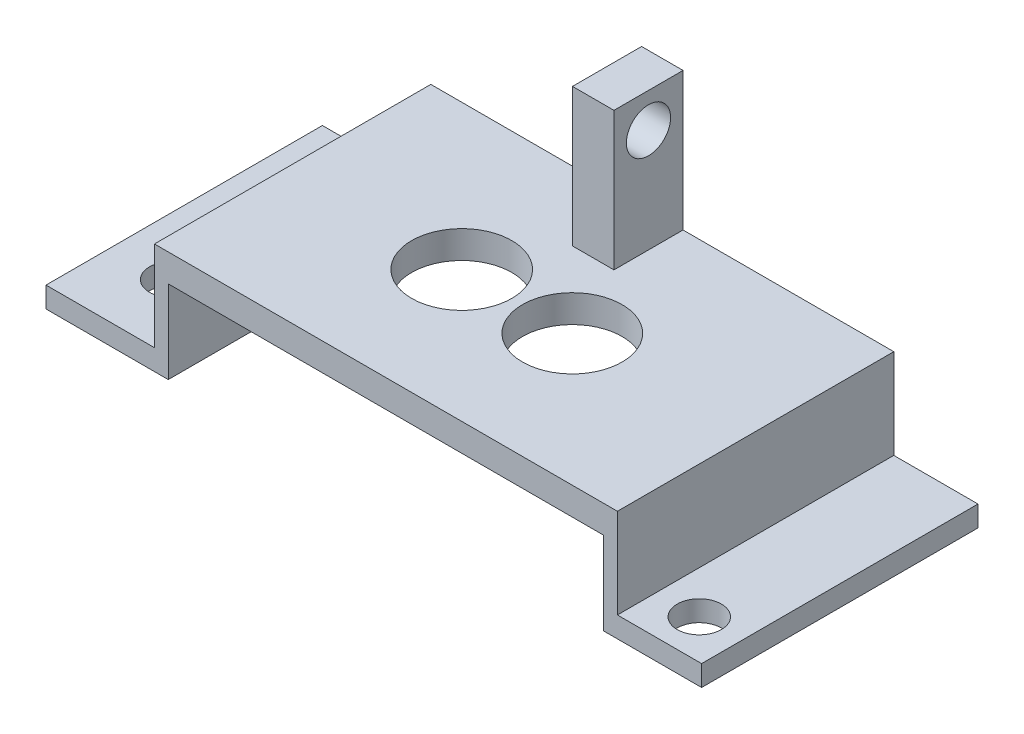
ISO-10303-21;
HEADER;
FILE_DESCRIPTION(('STEP AP214'),'2;1');
FILE_NAME('part.step','',(''),(''),'','','');
FILE_SCHEMA(('AUTOMOTIVE_DESIGN { 1 0 10303 214 1 1 1 1 }'));
ENDSEC;
DATA;
#1=APPLICATION_CONTEXT('core data for automotive mechanical design processes');
#2=APPLICATION_PROTOCOL_DEFINITION('international standard','automotive_design',2000,#1);
#3=PRODUCT_CONTEXT('',#1,'mechanical');
#4=PRODUCT('Part','Part','',(#3));
#5=PRODUCT_RELATED_PRODUCT_CATEGORY('part','',(#4));
#6=PRODUCT_DEFINITION_FORMATION('','',#4);
#7=PRODUCT_DEFINITION_CONTEXT('part definition',#1,'design');
#8=PRODUCT_DEFINITION('design','',#6,#7);
#9=PRODUCT_DEFINITION_SHAPE('','',#8);
#10=(LENGTH_UNIT() NAMED_UNIT(*) SI_UNIT(.MILLI.,.METRE.));
#11=(NAMED_UNIT(*) PLANE_ANGLE_UNIT() SI_UNIT($,.RADIAN.));
#12=(NAMED_UNIT(*) SI_UNIT($,.STERADIAN.) SOLID_ANGLE_UNIT());
#13=UNCERTAINTY_MEASURE_WITH_UNIT(LENGTH_MEASURE(1.E-05),#10,'distance_accuracy_value','');
#14=(GEOMETRIC_REPRESENTATION_CONTEXT(3) GLOBAL_UNCERTAINTY_ASSIGNED_CONTEXT((#13)) GLOBAL_UNIT_ASSIGNED_CONTEXT((#10,
#11,#12)) REPRESENTATION_CONTEXT('',''));
#15=CARTESIAN_POINT('',(0.,0.,0.));
#16=DIRECTION('',(0.,0.,1.));
#17=DIRECTION('',(1.,0.,0.));
#18=AXIS2_PLACEMENT_3D('',#15,#16,#17);
#19=CARTESIAN_POINT('',(16.75,2.,0.));
#20=DIRECTION('',(1.,0.,0.));
#21=DIRECTION('',(0.,0.,-1.));
#22=AXIS2_PLACEMENT_3D('',#19,#20,#21);
#23=PLANE('',#22);
#24=DIRECTION('',(0.,-1.,0.));
#25=VECTOR('',#24,1.);
#26=CARTESIAN_POINT('',(16.75,2.,7.5));
#27=LINE('',#26,#25);
#28=CARTESIAN_POINT('',(16.75,2.,7.5));
#29=VERTEX_POINT('',#28);
#30=CARTESIAN_POINT('',(16.75,-4.5,7.5));
#31=VERTEX_POINT('',#30);
#32=EDGE_CURVE('E50',#29,#31,#27,.T.);
#33=ORIENTED_EDGE('',*,*,#32,.T.);
#34=DIRECTION('',(0.,0.,-1.));
#35=VECTOR('',#34,1.);
#36=CARTESIAN_POINT('',(16.75,-4.5,7.5));
#37=LINE('',#36,#35);
#38=CARTESIAN_POINT('',(16.75,-4.5,-12.5));
#39=VERTEX_POINT('',#38);
#40=EDGE_CURVE('E270',#31,#39,#37,.T.);
#41=ORIENTED_EDGE('',*,*,#40,.T.);
#42=DIRECTION('',(0.,-1.,0.));
#43=VECTOR('',#42,1.);
#44=CARTESIAN_POINT('',(16.75,2.,-12.5));
#45=LINE('',#44,#43);
#46=CARTESIAN_POINT('',(16.75,2.,-12.5));
#47=VERTEX_POINT('',#46);
#48=EDGE_CURVE('E191',#47,#39,#45,.T.);
#49=ORIENTED_EDGE('',*,*,#48,.F.);
#50=DIRECTION('',(0.,0.,1.));
#51=VECTOR('',#50,1.);
#52=CARTESIAN_POINT('',(16.75,2.,0.));
#53=LINE('',#52,#51);
#54=EDGE_CURVE('E329',#47,#29,#53,.T.);
#55=ORIENTED_EDGE('',*,*,#54,.T.);
#56=EDGE_LOOP('',(#33,#41,#49,#55));
#57=FACE_BOUND('',#56,.T.);
#58=ADVANCED_FACE('F41',(#57),#23,.T.);
#59=CARTESIAN_POINT('',(0.,0.,0.));
#60=DIRECTION('',(0.,1.,0.));
#61=DIRECTION('',(0.,0.,1.));
#62=AXIS2_PLACEMENT_3D('',#59,#60,#61);
#63=PLANE('',#62);
#64=CARTESIAN_POINT('',(-4.03250581234389,0.,-2.018294601441));
#65=DIRECTION('',(0.,1.,0.));
#66=DIRECTION('',(0.,0.,1.));
#67=AXIS2_PLACEMENT_3D('',#64,#65,#66);
#68=CIRCLE('',#67,3.62497896777103);
#69=CARTESIAN_POINT('',(-4.03250581234389,0.,1.60668436633003));
#70=VERTEX_POINT('',#69);
#71=EDGE_CURVE('E336',#70,#70,#68,.T.);
#72=ORIENTED_EDGE('',*,*,#71,.T.);
#73=EDGE_LOOP('',(#72));
#74=FACE_BOUND('',#73,.T.);
#75=CARTESIAN_POINT('',(3.96807402164159,0.,-2.018294601441));
#76=DIRECTION('',(0.,1.,0.));
#77=DIRECTION('',(0.,0.,1.));
#78=AXIS2_PLACEMENT_3D('',#75,#76,#77);
#79=CIRCLE('',#78,3.60228421034035);
#80=CARTESIAN_POINT('',(3.96807402164159,0.,1.58398960889935));
#81=VERTEX_POINT('',#80);
#82=EDGE_CURVE('E312',#81,#81,#79,.T.);
#83=ORIENTED_EDGE('',*,*,#82,.T.);
#84=EDGE_LOOP('',(#83));
#85=FACE_BOUND('',#84,.T.);
#86=DIRECTION('',(0.,0.,-1.));
#87=VECTOR('',#86,1.);
#88=CARTESIAN_POINT('',(15.75,0.,0.));
#89=LINE('',#88,#87);
#90=CARTESIAN_POINT('',(15.75,0.,7.5));
#91=VERTEX_POINT('',#90);
#92=CARTESIAN_POINT('',(15.75,0.,-12.5));
#93=VERTEX_POINT('',#92);
#94=EDGE_CURVE('E287',#91,#93,#89,.T.);
#95=ORIENTED_EDGE('',*,*,#94,.F.);
#96=DIRECTION('',(-1.,0.,0.));
#97=VECTOR('',#96,1.);
#98=CARTESIAN_POINT('',(0.,0.,7.5));
#99=LINE('',#98,#97);
#100=CARTESIAN_POINT('',(-15.75,0.,7.5));
#101=VERTEX_POINT('',#100);
#102=EDGE_CURVE('E318',#91,#101,#99,.T.);
#103=ORIENTED_EDGE('',*,*,#102,.T.);
#104=DIRECTION('',(0.,0.,-1.));
#105=VECTOR('',#104,1.);
#106=CARTESIAN_POINT('',(-15.75,0.,0.));
#107=LINE('',#106,#105);
#108=CARTESIAN_POINT('',(-15.75,0.,-12.5));
#109=VERTEX_POINT('',#108);
#110=EDGE_CURVE('E299',#101,#109,#107,.T.);
#111=ORIENTED_EDGE('',*,*,#110,.T.);
#112=DIRECTION('',(-1.,0.,0.));
#113=VECTOR('',#112,1.);
#114=CARTESIAN_POINT('',(15.75,0.,-12.5));
#115=LINE('',#114,#113);
#116=EDGE_CURVE('E211',#93,#109,#115,.T.);
#117=ORIENTED_EDGE('',*,*,#116,.F.);
#118=EDGE_LOOP('',(#95,#103,#111,#117));
#119=FACE_BOUND('',#118,.T.);
#120=ADVANCED_FACE('F381',(#74,#85,#119),#63,.F.);
#121=CARTESIAN_POINT('',(-16.75,2.,0.));
#122=DIRECTION('',(1.,0.,0.));
#123=DIRECTION('',(0.,0.,-1.));
#124=AXIS2_PLACEMENT_3D('',#121,#122,#123);
#125=PLANE('',#124);
#126=DIRECTION('',(0.,0.,1.));
#127=VECTOR('',#126,1.);
#128=CARTESIAN_POINT('',(-16.75,2.,0.));
#129=LINE('',#128,#127);
#130=CARTESIAN_POINT('',(-16.75,2.,-12.5));
#131=VERTEX_POINT('',#130);
#132=CARTESIAN_POINT('',(-16.75,2.,7.5));
#133=VERTEX_POINT('',#132);
#134=EDGE_CURVE('E322',#131,#133,#129,.T.);
#135=ORIENTED_EDGE('',*,*,#134,.F.);
#136=DIRECTION('',(0.,1.,0.));
#137=VECTOR('',#136,1.);
#138=CARTESIAN_POINT('',(-16.75,-4.5,-12.5));
#139=LINE('',#138,#137);
#140=CARTESIAN_POINT('',(-16.75,-4.5,-12.5));
#141=VERTEX_POINT('',#140);
#142=EDGE_CURVE('E231',#141,#131,#139,.T.);
#143=ORIENTED_EDGE('',*,*,#142,.F.);
#144=DIRECTION('',(0.,0.,1.));
#145=VECTOR('',#144,1.);
#146=CARTESIAN_POINT('',(-16.75,-4.5,7.5));
#147=LINE('',#146,#145);
#148=CARTESIAN_POINT('',(-16.75,-4.5,7.5));
#149=VERTEX_POINT('',#148);
#150=EDGE_CURVE('E244',#141,#149,#147,.T.);
#151=ORIENTED_EDGE('',*,*,#150,.T.);
#152=DIRECTION('',(0.,-1.,0.));
#153=VECTOR('',#152,1.);
#154=CARTESIAN_POINT('',(-16.75,2.,7.5));
#155=LINE('',#154,#153);
#156=EDGE_CURVE('E11',#133,#149,#155,.T.);
#157=ORIENTED_EDGE('',*,*,#156,.F.);
#158=EDGE_LOOP('',(#135,#143,#151,#157));
#159=FACE_BOUND('',#158,.T.);
#160=ADVANCED_FACE('F357',(#159),#125,.F.);
#161=CARTESIAN_POINT('',(0.,2.,7.5));
#162=DIRECTION('',(0.,0.,1.));
#163=DIRECTION('',(1.,0.,0.));
#164=AXIS2_PLACEMENT_3D('',#161,#162,#163);
#165=PLANE('',#164);
#166=ORIENTED_EDGE('',*,*,#102,.F.);
#167=DIRECTION('',(0.,1.,0.));
#168=VECTOR('',#167,1.);
#169=CARTESIAN_POINT('',(15.75,-6.,7.5));
#170=LINE('',#169,#168);
#171=CARTESIAN_POINT('',(15.75,-6.,7.5));
#172=VERTEX_POINT('',#171);
#173=EDGE_CURVE('E294',#172,#91,#170,.T.);
#174=ORIENTED_EDGE('',*,*,#173,.F.);
#175=DIRECTION('',(1.,0.,0.));
#176=VECTOR('',#175,1.);
#177=CARTESIAN_POINT('',(0.,-6.,7.5));
#178=LINE('',#177,#176);
#179=CARTESIAN_POINT('',(22.8427393129618,-6.,7.5));
#180=VERTEX_POINT('',#179);
#181=EDGE_CURVE('E291',#172,#180,#178,.T.);
#182=ORIENTED_EDGE('',*,*,#181,.T.);
#183=DIRECTION('',(0.,-1.,0.));
#184=VECTOR('',#183,1.);
#185=CARTESIAN_POINT('',(22.8427393129618,-4.5,7.5));
#186=LINE('',#185,#184);
#187=CARTESIAN_POINT('',(22.8427393129618,-4.5,7.5));
#188=VERTEX_POINT('',#187);
#189=EDGE_CURVE('E280',#188,#180,#186,.T.);
#190=ORIENTED_EDGE('',*,*,#189,.F.);
#191=DIRECTION('',(-1.,0.,0.));
#192=VECTOR('',#191,1.);
#193=CARTESIAN_POINT('',(16.75,-4.5,7.5));
#194=LINE('',#193,#192);
#195=EDGE_CURVE('E276',#188,#31,#194,.T.);
#196=ORIENTED_EDGE('',*,*,#195,.T.);
#197=ORIENTED_EDGE('',*,*,#32,.F.);
#198=DIRECTION('',(-1.,0.,0.));
#199=VECTOR('',#198,1.);
#200=CARTESIAN_POINT('',(0.,2.,7.5));
#201=LINE('',#200,#199);
#202=EDGE_CURVE('E325',#29,#133,#201,.T.);
#203=ORIENTED_EDGE('',*,*,#202,.T.);
#204=ORIENTED_EDGE('',*,*,#156,.T.);
#205=DIRECTION('',(-1.,0.,0.));
#206=VECTOR('',#205,1.);
#207=CARTESIAN_POINT('',(-16.75,-4.5,7.5));
#208=LINE('',#207,#206);
#209=CARTESIAN_POINT('',(-24.5971687459843,-4.5,7.5));
#210=VERTEX_POINT('',#209);
#211=EDGE_CURVE('E248',#149,#210,#208,.T.);
#212=ORIENTED_EDGE('',*,*,#211,.T.);
#213=DIRECTION('',(0.,-1.,0.));
#214=VECTOR('',#213,1.);
#215=CARTESIAN_POINT('',(-24.5971687459843,-4.5,7.5));
#216=LINE('',#215,#214);
#217=CARTESIAN_POINT('',(-24.5971687459843,-6.,7.5));
#218=VERTEX_POINT('',#217);
#219=EDGE_CURVE('E255',#210,#218,#216,.T.);
#220=ORIENTED_EDGE('',*,*,#219,.T.);
#221=DIRECTION('',(-1.,0.,0.));
#222=VECTOR('',#221,1.);
#223=CARTESIAN_POINT('',(0.,-6.,7.49999999999999));
#224=LINE('',#223,#222);
#225=CARTESIAN_POINT('',(-15.75,-6.,7.5));
#226=VERTEX_POINT('',#225);
#227=EDGE_CURVE('E300',#226,#218,#224,.T.);
#228=ORIENTED_EDGE('',*,*,#227,.F.);
#229=DIRECTION('',(0.,1.,0.));
#230=VECTOR('',#229,1.);
#231=CARTESIAN_POINT('',(-15.75,-6.,7.5));
#232=LINE('',#231,#230);
#233=EDGE_CURVE('E306',#226,#101,#232,.T.);
#234=ORIENTED_EDGE('',*,*,#233,.T.);
#235=EDGE_LOOP('',(#166,#174,#182,#190,#196,#197,#203,#204,#212,#220,#228,#234));
#236=FACE_BOUND('',#235,.T.);
#237=ADVANCED_FACE('F348',(#236),#165,.T.);
#238=CARTESIAN_POINT('',(-4.03250581234389,2.,-2.018294601441));
#239=DIRECTION('',(0.,-1.,0.));
#240=DIRECTION('',(0.,0.,-1.));
#241=AXIS2_PLACEMENT_3D('',#238,#239,#240);
#242=CYLINDRICAL_SURFACE('',#241,3.62497896777103);
#243=CARTESIAN_POINT('',(-4.03250581234389,2.,-2.018294601441));
#244=DIRECTION('',(0.,1.,0.));
#245=DIRECTION('',(0.,0.,1.));
#246=AXIS2_PLACEMENT_3D('',#243,#244,#245);
#247=CIRCLE('',#246,3.62497896777103);
#248=CARTESIAN_POINT('',(-4.03250581234389,2.,1.60668436633003));
#249=VERTEX_POINT('',#248);
#250=EDGE_CURVE('E317',#249,#249,#247,.T.);
#251=ORIENTED_EDGE('',*,*,#250,.T.);
#252=EDGE_LOOP('',(#251));
#253=FACE_BOUND('',#252,.T.);
#254=ORIENTED_EDGE('',*,*,#71,.F.);
#255=EDGE_LOOP('',(#254));
#256=FACE_BOUND('',#255,.T.);
#257=ADVANCED_FACE('F422',(#253,#256),#242,.F.);
#258=CARTESIAN_POINT('',(3.96807402164159,2.,-2.018294601441));
#259=DIRECTION('',(0.,-1.,0.));
#260=DIRECTION('',(0.,0.,-1.));
#261=AXIS2_PLACEMENT_3D('',#258,#259,#260);
#262=CYLINDRICAL_SURFACE('',#261,3.60228421034035);
#263=CARTESIAN_POINT('',(3.96807402164159,2.,-2.018294601441));
#264=DIRECTION('',(0.,1.,0.));
#265=DIRECTION('',(0.,0.,1.));
#266=AXIS2_PLACEMENT_3D('',#263,#264,#265);
#267=CIRCLE('',#266,3.60228421034035);
#268=CARTESIAN_POINT('',(3.96807402164159,2.,1.58398960889935));
#269=VERTEX_POINT('',#268);
#270=EDGE_CURVE('E313',#269,#269,#267,.T.);
#271=ORIENTED_EDGE('',*,*,#270,.T.);
#272=EDGE_LOOP('',(#271));
#273=FACE_BOUND('',#272,.T.);
#274=ORIENTED_EDGE('',*,*,#82,.F.);
#275=EDGE_LOOP('',(#274));
#276=FACE_BOUND('',#275,.T.);
#277=ADVANCED_FACE('F43',(#273,#276),#262,.F.);
#278=CARTESIAN_POINT('',(0.,2.,0.));
#279=DIRECTION('',(0.,1.,0.));
#280=DIRECTION('',(0.,0.,1.));
#281=AXIS2_PLACEMENT_3D('',#278,#279,#280);
#282=PLANE('',#281);
#283=DIRECTION('',(0.,0.,1.));
#284=VECTOR('',#283,1.);
#285=CARTESIAN_POINT('',(-1.5,2.,-7.5));
#286=LINE('',#285,#284);
#287=CARTESIAN_POINT('',(-1.5,2.,-12.5));
#288=VERTEX_POINT('',#287);
#289=CARTESIAN_POINT('',(-1.5,2.,-7.5));
#290=VERTEX_POINT('',#289);
#291=EDGE_CURVE('E178',#288,#290,#286,.T.);
#292=ORIENTED_EDGE('',*,*,#291,.F.);
#293=DIRECTION('',(1.,0.,0.));
#294=VECTOR('',#293,1.);
#295=CARTESIAN_POINT('',(-16.75,2.,-12.5));
#296=LINE('',#295,#294);
#297=EDGE_CURVE('E183',#131,#288,#296,.T.);
#298=ORIENTED_EDGE('',*,*,#297,.F.);
#299=ORIENTED_EDGE('',*,*,#134,.T.);
#300=ORIENTED_EDGE('',*,*,#202,.F.);
#301=ORIENTED_EDGE('',*,*,#54,.F.);
#302=CARTESIAN_POINT('',(1.5,2.,-12.5));
#303=VERTEX_POINT('',#302);
#304=EDGE_CURVE('E63',#303,#47,#296,.T.);
#305=ORIENTED_EDGE('',*,*,#304,.F.);
#306=DIRECTION('',(0.,0.,-1.));
#307=VECTOR('',#306,1.);
#308=CARTESIAN_POINT('',(1.5,2.,-7.5));
#309=LINE('',#308,#307);
#310=CARTESIAN_POINT('',(1.5,2.,-7.5));
#311=VERTEX_POINT('',#310);
#312=EDGE_CURVE('E175',#311,#303,#309,.T.);
#313=ORIENTED_EDGE('',*,*,#312,.F.);
#314=DIRECTION('',(1.,0.,0.));
#315=VECTOR('',#314,1.);
#316=CARTESIAN_POINT('',(1.5,2.,-7.5));
#317=LINE('',#316,#315);
#318=EDGE_CURVE('E57',#290,#311,#317,.T.);
#319=ORIENTED_EDGE('',*,*,#318,.F.);
#320=EDGE_LOOP('',(#292,#298,#299,#300,#301,#305,#313,#319));
#321=FACE_BOUND('',#320,.T.);
#322=ORIENTED_EDGE('',*,*,#270,.F.);
#323=EDGE_LOOP('',(#322));
#324=FACE_BOUND('',#323,.T.);
#325=ORIENTED_EDGE('',*,*,#250,.F.);
#326=EDGE_LOOP('',(#325));
#327=FACE_BOUND('',#326,.T.);
#328=ADVANCED_FACE('F351',(#321,#324,#327),#282,.T.);
#329=CARTESIAN_POINT('',(-15.75,-6.,0.));
#330=DIRECTION('',(1.,0.,0.));
#331=DIRECTION('',(0.,0.,-1.));
#332=AXIS2_PLACEMENT_3D('',#329,#330,#331);
#333=PLANE('',#332);
#334=ORIENTED_EDGE('',*,*,#110,.F.);
#335=ORIENTED_EDGE('',*,*,#233,.F.);
#336=DIRECTION('',(0.,0.,-1.));
#337=VECTOR('',#336,1.);
#338=CARTESIAN_POINT('',(-15.75,-6.,0.));
#339=LINE('',#338,#337);
#340=CARTESIAN_POINT('',(-15.75,-6.,-12.5));
#341=VERTEX_POINT('',#340);
#342=EDGE_CURVE('E303',#226,#341,#339,.T.);
#343=ORIENTED_EDGE('',*,*,#342,.T.);
#344=DIRECTION('',(0.,-1.,0.));
#345=VECTOR('',#344,1.);
#346=CARTESIAN_POINT('',(-15.75,0.,-12.5));
#347=LINE('',#346,#345);
#348=EDGE_CURVE('E215',#109,#341,#347,.T.);
#349=ORIENTED_EDGE('',*,*,#348,.F.);
#350=EDGE_LOOP('',(#334,#335,#343,#349));
#351=FACE_BOUND('',#350,.T.);
#352=ADVANCED_FACE('F377',(#351),#333,.T.);
#353=CARTESIAN_POINT('',(0.,-6.,0.));
#354=DIRECTION('',(0.,1.,0.));
#355=DIRECTION('',(0.,0.,1.));
#356=AXIS2_PLACEMENT_3D('',#353,#354,#355);
#357=PLANE('',#356);
#358=DIRECTION('',(0.,0.,-1.));
#359=VECTOR('',#358,1.);
#360=CARTESIAN_POINT('',(-24.5971687459843,-6.,-7.5));
#361=LINE('',#360,#359);
#362=CARTESIAN_POINT('',(-24.5971687459843,-6.,-12.5));
#363=VERTEX_POINT('',#362);
#364=EDGE_CURVE('E240',#218,#363,#361,.T.);
#365=ORIENTED_EDGE('',*,*,#364,.T.);
#366=DIRECTION('',(-1.,0.,0.));
#367=VECTOR('',#366,1.);
#368=CARTESIAN_POINT('',(-15.75,-6.,-12.5));
#369=LINE('',#368,#367);
#370=EDGE_CURVE('E219',#341,#363,#369,.T.);
#371=ORIENTED_EDGE('',*,*,#370,.F.);
#372=ORIENTED_EDGE('',*,*,#342,.F.);
#373=ORIENTED_EDGE('',*,*,#227,.T.);
#374=EDGE_LOOP('',(#365,#371,#372,#373));
#375=FACE_BOUND('',#374,.T.);
#376=CARTESIAN_POINT('',(-20.3951356730416,-6.,2.61052916026758));
#377=DIRECTION('',(0.,-1.,0.));
#378=DIRECTION('',(0.,0.,-1.));
#379=AXIS2_PLACEMENT_3D('',#376,#377,#378);
#380=CIRCLE('',#379,1.6);
#381=CARTESIAN_POINT('',(-20.3951356730416,-6.,1.01052916026758));
#382=VERTEX_POINT('',#381);
#383=EDGE_CURVE('E235',#382,#382,#380,.T.);
#384=ORIENTED_EDGE('',*,*,#383,.F.);
#385=EDGE_LOOP('',(#384));
#386=FACE_BOUND('',#385,.T.);
#387=ADVANCED_FACE('F373',(#375,#386),#357,.F.);
#388=CARTESIAN_POINT('',(15.75,-6.,0.));
#389=DIRECTION('',(1.,0.,0.));
#390=DIRECTION('',(0.,0.,-1.));
#391=AXIS2_PLACEMENT_3D('',#388,#389,#390);
#392=PLANE('',#391);
#393=ORIENTED_EDGE('',*,*,#94,.T.);
#394=DIRECTION('',(0.,1.,0.));
#395=VECTOR('',#394,1.);
#396=CARTESIAN_POINT('',(15.75,-6.,-12.5));
#397=LINE('',#396,#395);
#398=CARTESIAN_POINT('',(15.75,-6.,-12.5));
#399=VERTEX_POINT('',#398);
#400=EDGE_CURVE('E207',#399,#93,#397,.T.);
#401=ORIENTED_EDGE('',*,*,#400,.F.);
#402=DIRECTION('',(0.,0.,-1.));
#403=VECTOR('',#402,1.);
#404=CARTESIAN_POINT('',(15.75,-6.,0.));
#405=LINE('',#404,#403);
#406=EDGE_CURVE('E288',#172,#399,#405,.T.);
#407=ORIENTED_EDGE('',*,*,#406,.F.);
#408=ORIENTED_EDGE('',*,*,#173,.T.);
#409=EDGE_LOOP('',(#393,#401,#407,#408));
#410=FACE_BOUND('',#409,.T.);
#411=ADVANCED_FACE('F386',(#410),#392,.F.);
#412=CARTESIAN_POINT('',(0.,-6.,0.));
#413=DIRECTION('',(0.,1.,0.));
#414=DIRECTION('',(0.,0.,1.));
#415=AXIS2_PLACEMENT_3D('',#412,#413,#414);
#416=PLANE('',#415);
#417=ORIENTED_EDGE('',*,*,#406,.T.);
#418=DIRECTION('',(-1.,0.,0.));
#419=VECTOR('',#418,1.);
#420=CARTESIAN_POINT('',(22.8427393129618,-6.,-12.5));
#421=LINE('',#420,#419);
#422=CARTESIAN_POINT('',(22.8427393129618,-6.,-12.5));
#423=VERTEX_POINT('',#422);
#424=EDGE_CURVE('E203',#423,#399,#421,.T.);
#425=ORIENTED_EDGE('',*,*,#424,.F.);
#426=DIRECTION('',(0.,0.,1.));
#427=VECTOR('',#426,1.);
#428=CARTESIAN_POINT('',(22.8427393129618,-6.,7.5));
#429=LINE('',#428,#427);
#430=EDGE_CURVE('E266',#423,#180,#429,.T.);
#431=ORIENTED_EDGE('',*,*,#430,.T.);
#432=ORIENTED_EDGE('',*,*,#181,.F.);
#433=EDGE_LOOP('',(#417,#425,#431,#432));
#434=FACE_BOUND('',#433,.T.);
#435=CARTESIAN_POINT('',(19.8266981254099,-6.,4.65188345676817));
#436=DIRECTION('',(0.,-1.,0.));
#437=DIRECTION('',(0.,0.,-1.));
#438=AXIS2_PLACEMENT_3D('',#435,#436,#437);
#439=CIRCLE('',#438,1.6);
#440=CARTESIAN_POINT('',(19.8266981254099,-6.,3.05188345676817));
#441=VERTEX_POINT('',#440);
#442=EDGE_CURVE('E261',#441,#441,#439,.T.);
#443=ORIENTED_EDGE('',*,*,#442,.F.);
#444=EDGE_LOOP('',(#443));
#445=FACE_BOUND('',#444,.T.);
#446=ADVANCED_FACE('F392',(#434,#445),#416,.F.);
#447=CARTESIAN_POINT('',(22.8427393129618,-4.5,7.5));
#448=DIRECTION('',(1.,0.,0.));
#449=DIRECTION('',(0.,0.,-1.));
#450=AXIS2_PLACEMENT_3D('',#447,#448,#449);
#451=PLANE('',#450);
#452=ORIENTED_EDGE('',*,*,#430,.F.);
#453=DIRECTION('',(0.,-1.,0.));
#454=VECTOR('',#453,1.);
#455=CARTESIAN_POINT('',(22.8427393129618,-4.5,-12.5));
#456=LINE('',#455,#454);
#457=CARTESIAN_POINT('',(22.8427393129618,-4.5,-12.5));
#458=VERTEX_POINT('',#457);
#459=EDGE_CURVE('E199',#458,#423,#456,.T.);
#460=ORIENTED_EDGE('',*,*,#459,.F.);
#461=DIRECTION('',(0.,0.,1.));
#462=VECTOR('',#461,1.);
#463=CARTESIAN_POINT('',(22.8427393129618,-4.5,-7.5));
#464=LINE('',#463,#462);
#465=EDGE_CURVE('E273',#458,#188,#464,.T.);
#466=ORIENTED_EDGE('',*,*,#465,.T.);
#467=ORIENTED_EDGE('',*,*,#189,.T.);
#468=EDGE_LOOP('',(#452,#460,#466,#467));
#469=FACE_BOUND('',#468,.T.);
#470=ADVANCED_FACE('F390',(#469),#451,.T.);
#471=CARTESIAN_POINT('',(0.,-4.5,0.));
#472=DIRECTION('',(0.,-1.,0.));
#473=DIRECTION('',(0.,0.,-1.));
#474=AXIS2_PLACEMENT_3D('',#471,#472,#473);
#475=PLANE('',#474);
#476=CARTESIAN_POINT('',(19.8266981254099,-4.5,4.65188345676817));
#477=DIRECTION('',(0.,-1.,0.));
#478=DIRECTION('',(0.,0.,-1.));
#479=AXIS2_PLACEMENT_3D('',#476,#477,#478);
#480=CIRCLE('',#479,1.6);
#481=CARTESIAN_POINT('',(19.8266981254099,-4.5,3.05188345676817));
#482=VERTEX_POINT('',#481);
#483=EDGE_CURVE('E262',#482,#482,#480,.T.);
#484=ORIENTED_EDGE('',*,*,#483,.T.);
#485=EDGE_LOOP('',(#484));
#486=FACE_BOUND('',#485,.T.);
#487=ORIENTED_EDGE('',*,*,#40,.F.);
#488=ORIENTED_EDGE('',*,*,#195,.F.);
#489=ORIENTED_EDGE('',*,*,#465,.F.);
#490=DIRECTION('',(1.,0.,0.));
#491=VECTOR('',#490,1.);
#492=CARTESIAN_POINT('',(16.75,-4.5,-12.5));
#493=LINE('',#492,#491);
#494=EDGE_CURVE('E195',#39,#458,#493,.T.);
#495=ORIENTED_EDGE('',*,*,#494,.F.);
#496=EDGE_LOOP('',(#487,#488,#489,#495));
#497=FACE_BOUND('',#496,.T.);
#498=ADVANCED_FACE('F400',(#486,#497),#475,.F.);
#499=CARTESIAN_POINT('',(19.8266981254099,-4.5,4.65188345676817));
#500=DIRECTION('',(0.,-1.,0.));
#501=DIRECTION('',(0.,0.,-1.));
#502=AXIS2_PLACEMENT_3D('',#499,#500,#501);
#503=CYLINDRICAL_SURFACE('',#502,1.6);
#504=ORIENTED_EDGE('',*,*,#483,.F.);
#505=EDGE_LOOP('',(#504));
#506=FACE_BOUND('',#505,.T.);
#507=ORIENTED_EDGE('',*,*,#442,.T.);
#508=EDGE_LOOP('',(#507));
#509=FACE_BOUND('',#508,.T.);
#510=ADVANCED_FACE('F398',(#506,#509),#503,.F.);
#511=CARTESIAN_POINT('',(-24.5971687459843,-4.5,-7.5));
#512=DIRECTION('',(-1.,0.,0.));
#513=DIRECTION('',(0.,0.,1.));
#514=AXIS2_PLACEMENT_3D('',#511,#512,#513);
#515=PLANE('',#514);
#516=ORIENTED_EDGE('',*,*,#364,.F.);
#517=ORIENTED_EDGE('',*,*,#219,.F.);
#518=DIRECTION('',(0.,0.,-1.));
#519=VECTOR('',#518,1.);
#520=CARTESIAN_POINT('',(-24.5971687459843,-4.5,7.5));
#521=LINE('',#520,#519);
#522=CARTESIAN_POINT('',(-24.5971687459843,-4.5,-12.5));
#523=VERTEX_POINT('',#522);
#524=EDGE_CURVE('E252',#210,#523,#521,.T.);
#525=ORIENTED_EDGE('',*,*,#524,.T.);
#526=DIRECTION('',(0.,1.,0.));
#527=VECTOR('',#526,1.);
#528=CARTESIAN_POINT('',(-24.5971687459843,-6.,-12.5));
#529=LINE('',#528,#527);
#530=EDGE_CURVE('E223',#363,#523,#529,.T.);
#531=ORIENTED_EDGE('',*,*,#530,.F.);
#532=EDGE_LOOP('',(#516,#517,#525,#531));
#533=FACE_BOUND('',#532,.T.);
#534=ADVANCED_FACE('F366',(#533),#515,.T.);
#535=CARTESIAN_POINT('',(0.,-4.5,0.));
#536=DIRECTION('',(0.,1.,0.));
#537=DIRECTION('',(0.,0.,1.));
#538=AXIS2_PLACEMENT_3D('',#535,#536,#537);
#539=PLANE('',#538);
#540=CARTESIAN_POINT('',(-20.3951356730416,-4.5,2.61052916026758));
#541=DIRECTION('',(0.,-1.,0.));
#542=DIRECTION('',(0.,0.,-1.));
#543=AXIS2_PLACEMENT_3D('',#540,#541,#542);
#544=CIRCLE('',#543,1.6);
#545=CARTESIAN_POINT('',(-20.3951356730416,-4.5,1.01052916026758));
#546=VERTEX_POINT('',#545);
#547=EDGE_CURVE('E236',#546,#546,#544,.T.);
#548=ORIENTED_EDGE('',*,*,#547,.T.);
#549=EDGE_LOOP('',(#548));
#550=FACE_BOUND('',#549,.T.);
#551=ORIENTED_EDGE('',*,*,#150,.F.);
#552=DIRECTION('',(1.,0.,0.));
#553=VECTOR('',#552,1.);
#554=CARTESIAN_POINT('',(-24.5971687459843,-4.5,-12.5));
#555=LINE('',#554,#553);
#556=EDGE_CURVE('E227',#523,#141,#555,.T.);
#557=ORIENTED_EDGE('',*,*,#556,.F.);
#558=ORIENTED_EDGE('',*,*,#524,.F.);
#559=ORIENTED_EDGE('',*,*,#211,.F.);
#560=EDGE_LOOP('',(#551,#557,#558,#559));
#561=FACE_BOUND('',#560,.T.);
#562=ADVANCED_FACE('F361',(#550,#561),#539,.T.);
#563=CARTESIAN_POINT('',(-20.3951356730416,-4.5,2.61052916026758));
#564=DIRECTION('',(0.,-1.,0.));
#565=DIRECTION('',(0.,0.,-1.));
#566=AXIS2_PLACEMENT_3D('',#563,#564,#565);
#567=CYLINDRICAL_SURFACE('',#566,1.6);
#568=ORIENTED_EDGE('',*,*,#547,.F.);
#569=EDGE_LOOP('',(#568));
#570=FACE_BOUND('',#569,.T.);
#571=ORIENTED_EDGE('',*,*,#383,.T.);
#572=EDGE_LOOP('',(#571));
#573=FACE_BOUND('',#572,.T.);
#574=ADVANCED_FACE('F472',(#570,#573),#567,.F.);
#575=CARTESIAN_POINT('',(0.,0.,-12.5));
#576=DIRECTION('',(0.,0.,-1.));
#577=DIRECTION('',(-1.,0.,0.));
#578=AXIS2_PLACEMENT_3D('',#575,#576,#577);
#579=PLANE('',#578);
#580=ORIENTED_EDGE('',*,*,#297,.T.);
#581=DIRECTION('',(0.,-1.,0.));
#582=VECTOR('',#581,1.);
#583=CARTESIAN_POINT('',(-1.5,12.,-12.5));
#584=LINE('',#583,#582);
#585=CARTESIAN_POINT('',(-1.5,12.,-12.5));
#586=VERTEX_POINT('',#585);
#587=EDGE_CURVE('E713',#586,#288,#584,.T.);
#588=ORIENTED_EDGE('',*,*,#587,.F.);
#589=DIRECTION('',(-1.,0.,0.));
#590=VECTOR('',#589,1.);
#591=CARTESIAN_POINT('',(1.5,12.,-12.5));
#592=LINE('',#591,#590);
#593=CARTESIAN_POINT('',(1.5,12.,-12.5));
#594=VERTEX_POINT('',#593);
#595=EDGE_CURVE('E170',#594,#586,#592,.T.);
#596=ORIENTED_EDGE('',*,*,#595,.F.);
#597=DIRECTION('',(0.,-1.,0.));
#598=VECTOR('',#597,1.);
#599=CARTESIAN_POINT('',(1.5,12.,-12.5));
#600=LINE('',#599,#598);
#601=EDGE_CURVE('E185',#594,#303,#600,.T.);
#602=ORIENTED_EDGE('',*,*,#601,.T.);
#603=ORIENTED_EDGE('',*,*,#304,.T.);
#604=ORIENTED_EDGE('',*,*,#48,.T.);
#605=ORIENTED_EDGE('',*,*,#494,.T.);
#606=ORIENTED_EDGE('',*,*,#459,.T.);
#607=ORIENTED_EDGE('',*,*,#424,.T.);
#608=ORIENTED_EDGE('',*,*,#400,.T.);
#609=ORIENTED_EDGE('',*,*,#116,.T.);
#610=ORIENTED_EDGE('',*,*,#348,.T.);
#611=ORIENTED_EDGE('',*,*,#370,.T.);
#612=ORIENTED_EDGE('',*,*,#530,.T.);
#613=ORIENTED_EDGE('',*,*,#556,.T.);
#614=ORIENTED_EDGE('',*,*,#142,.T.);
#615=EDGE_LOOP('',(#580,#588,#596,#602,#603,#604,#605,#606,#607,#608,#609,#610,#611,#612,#613,#614));
#616=FACE_BOUND('',#615,.T.);
#617=ADVANCED_FACE('F368',(#616),#579,.T.);
#618=CARTESIAN_POINT('',(-1.5,12.,-7.5));
#619=DIRECTION('',(1.,0.,0.));
#620=DIRECTION('',(0.,0.,-1.));
#621=AXIS2_PLACEMENT_3D('',#618,#619,#620);
#622=PLANE('',#621);
#623=CARTESIAN_POINT('',(-1.5,9.5,-9.99999999999999));
#624=DIRECTION('',(1.,0.,0.));
#625=DIRECTION('',(0.,0.,-1.));
#626=AXIS2_PLACEMENT_3D('',#623,#624,#625);
#627=CIRCLE('',#626,1.6);
#628=CARTESIAN_POINT('',(-1.5,9.5,-11.6));
#629=VERTEX_POINT('',#628);
#630=EDGE_CURVE('E702',#629,#629,#627,.T.);
#631=ORIENTED_EDGE('',*,*,#630,.T.);
#632=EDGE_LOOP('',(#631));
#633=FACE_BOUND('',#632,.T.);
#634=ORIENTED_EDGE('',*,*,#291,.T.);
#635=DIRECTION('',(0.,-1.,0.));
#636=VECTOR('',#635,1.);
#637=CARTESIAN_POINT('',(-1.5,12.,-7.5));
#638=LINE('',#637,#636);
#639=CARTESIAN_POINT('',(-1.5,12.,-7.5));
#640=VERTEX_POINT('',#639);
#641=EDGE_CURVE('E157',#640,#290,#638,.T.);
#642=ORIENTED_EDGE('',*,*,#641,.F.);
#643=DIRECTION('',(0.,0.,1.));
#644=VECTOR('',#643,1.);
#645=CARTESIAN_POINT('',(-1.5,12.,-7.5));
#646=LINE('',#645,#644);
#647=EDGE_CURVE('E165',#586,#640,#646,.T.);
#648=ORIENTED_EDGE('',*,*,#647,.F.);
#649=ORIENTED_EDGE('',*,*,#587,.T.);
#650=EDGE_LOOP('',(#634,#642,#648,#649));
#651=FACE_BOUND('',#650,.T.);
#652=ADVANCED_FACE('F177',(#633,#651),#622,.F.);
#653=CARTESIAN_POINT('',(1.5,12.,-7.5));
#654=DIRECTION('',(0.,0.,-1.));
#655=DIRECTION('',(-1.,0.,0.));
#656=AXIS2_PLACEMENT_3D('',#653,#654,#655);
#657=PLANE('',#656);
#658=ORIENTED_EDGE('',*,*,#318,.T.);
#659=DIRECTION('',(0.,-1.,0.));
#660=VECTOR('',#659,1.);
#661=CARTESIAN_POINT('',(1.5,12.,-7.5));
#662=LINE('',#661,#660);
#663=CARTESIAN_POINT('',(1.5,12.,-7.5));
#664=VERTEX_POINT('',#663);
#665=EDGE_CURVE('E160',#664,#311,#662,.T.);
#666=ORIENTED_EDGE('',*,*,#665,.F.);
#667=DIRECTION('',(1.,0.,0.));
#668=VECTOR('',#667,1.);
#669=CARTESIAN_POINT('',(1.5,12.,-7.5));
#670=LINE('',#669,#668);
#671=EDGE_CURVE('E153',#640,#664,#670,.T.);
#672=ORIENTED_EDGE('',*,*,#671,.F.);
#673=ORIENTED_EDGE('',*,*,#641,.T.);
#674=EDGE_LOOP('',(#658,#666,#672,#673));
#675=FACE_BOUND('',#674,.T.);
#676=ADVANCED_FACE('F155',(#675),#657,.F.);
#677=CARTESIAN_POINT('',(1.5,12.,-7.5));
#678=DIRECTION('',(-1.,0.,0.));
#679=DIRECTION('',(0.,0.,1.));
#680=AXIS2_PLACEMENT_3D('',#677,#678,#679);
#681=PLANE('',#680);
#682=CARTESIAN_POINT('',(1.5,9.5,-9.99999999999999));
#683=DIRECTION('',(1.,0.,0.));
#684=DIRECTION('',(0.,0.,-1.));
#685=AXIS2_PLACEMENT_3D('',#682,#683,#684);
#686=CIRCLE('',#685,1.6);
#687=CARTESIAN_POINT('',(1.5,9.5,-11.6));
#688=VERTEX_POINT('',#687);
#689=EDGE_CURVE('E699',#688,#688,#686,.T.);
#690=ORIENTED_EDGE('',*,*,#689,.F.);
#691=EDGE_LOOP('',(#690));
#692=FACE_BOUND('',#691,.T.);
#693=ORIENTED_EDGE('',*,*,#312,.T.);
#694=ORIENTED_EDGE('',*,*,#601,.F.);
#695=DIRECTION('',(0.,0.,-1.));
#696=VECTOR('',#695,1.);
#697=CARTESIAN_POINT('',(1.5,12.,-7.5));
#698=LINE('',#697,#696);
#699=EDGE_CURVE('E164',#664,#594,#698,.T.);
#700=ORIENTED_EDGE('',*,*,#699,.F.);
#701=ORIENTED_EDGE('',*,*,#665,.T.);
#702=EDGE_LOOP('',(#693,#694,#700,#701));
#703=FACE_BOUND('',#702,.T.);
#704=ADVANCED_FACE('F503',(#692,#703),#681,.F.);
#705=CARTESIAN_POINT('',(0.,12.,0.));
#706=DIRECTION('',(0.,1.,0.));
#707=DIRECTION('',(0.,0.,1.));
#708=AXIS2_PLACEMENT_3D('',#705,#706,#707);
#709=PLANE('',#708);
#710=ORIENTED_EDGE('',*,*,#647,.T.);
#711=ORIENTED_EDGE('',*,*,#671,.T.);
#712=ORIENTED_EDGE('',*,*,#699,.T.);
#713=ORIENTED_EDGE('',*,*,#595,.T.);
#714=EDGE_LOOP('',(#710,#711,#712,#713));
#715=FACE_BOUND('',#714,.T.);
#716=ADVANCED_FACE('F168',(#715),#709,.T.);
#717=CARTESIAN_POINT('',(-8.5,9.5,-9.99999999999999));
#718=DIRECTION('',(1.,0.,0.));
#719=DIRECTION('',(0.,0.,-1.));
#720=AXIS2_PLACEMENT_3D('',#717,#718,#719);
#721=CYLINDRICAL_SURFACE('',#720,1.6);
#722=ORIENTED_EDGE('',*,*,#689,.T.);
#723=EDGE_LOOP('',(#722));
#724=FACE_BOUND('',#723,.T.);
#725=ORIENTED_EDGE('',*,*,#630,.F.);
#726=EDGE_LOOP('',(#725));
#727=FACE_BOUND('',#726,.T.);
#728=ADVANCED_FACE('F514',(#724,#727),#721,.F.);
#729=CLOSED_SHELL('',(#58,#120,#160,#237,#257,#277,#328,#352,#387,#411,#446,#470,#498,#510,#534,
#562,#574,#617,#652,#676,#704,#716,#728));
#730=MANIFOLD_SOLID_BREP('B2',#729);
#731=ADVANCED_BREP_SHAPE_REPRESENTATION('',(#18,#730),#14);
#732=SHAPE_DEFINITION_REPRESENTATION(#9,#731);
ENDSEC;
END-ISO-10303-21;
